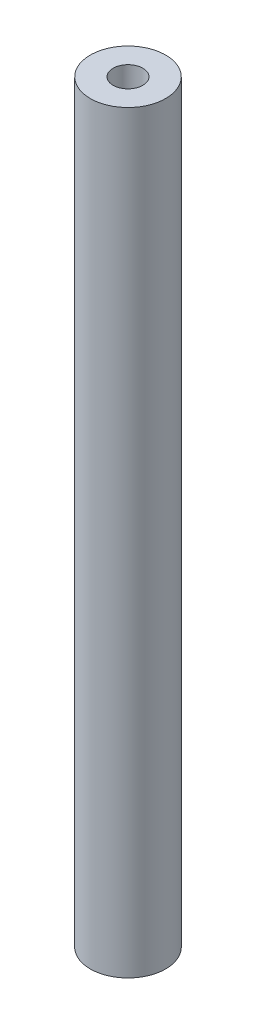
ISO-10303-21;
HEADER;
FILE_DESCRIPTION(('STEP AP214'),'2;1');
FILE_NAME('part.step','',(''),(''),'','','');
FILE_SCHEMA(('AUTOMOTIVE_DESIGN { 1 0 10303 214 1 1 1 1 }'));
ENDSEC;
DATA;
#1=APPLICATION_CONTEXT('core data for automotive mechanical design processes');
#2=APPLICATION_PROTOCOL_DEFINITION('international standard','automotive_design',2000,#1);
#3=PRODUCT_CONTEXT('',#1,'mechanical');
#4=PRODUCT('Part','Part','',(#3));
#5=PRODUCT_RELATED_PRODUCT_CATEGORY('part','',(#4));
#6=PRODUCT_DEFINITION_FORMATION('','',#4);
#7=PRODUCT_DEFINITION_CONTEXT('part definition',#1,'design');
#8=PRODUCT_DEFINITION('design','',#6,#7);
#9=PRODUCT_DEFINITION_SHAPE('','',#8);
#10=(LENGTH_UNIT() NAMED_UNIT(*) SI_UNIT(.MILLI.,.METRE.));
#11=(NAMED_UNIT(*) PLANE_ANGLE_UNIT() SI_UNIT($,.RADIAN.));
#12=(NAMED_UNIT(*) SI_UNIT($,.STERADIAN.) SOLID_ANGLE_UNIT());
#13=UNCERTAINTY_MEASURE_WITH_UNIT(LENGTH_MEASURE(1.E-05),#10,'distance_accuracy_value','');
#14=(GEOMETRIC_REPRESENTATION_CONTEXT(3) GLOBAL_UNCERTAINTY_ASSIGNED_CONTEXT((#13)) GLOBAL_UNIT_ASSIGNED_CONTEXT((#10,
#11,#12)) REPRESENTATION_CONTEXT('',''));
#15=CARTESIAN_POINT('',(0.,0.,0.));
#16=DIRECTION('',(0.,0.,1.));
#17=DIRECTION('',(1.,0.,0.));
#18=AXIS2_PLACEMENT_3D('',#15,#16,#17);
#19=CARTESIAN_POINT('',(0.,63.5,0.));
#20=DIRECTION('',(0.,-1.,0.));
#21=DIRECTION('',(0.,0.,-1.));
#22=AXIS2_PLACEMENT_3D('',#19,#20,#21);
#23=CYLINDRICAL_SURFACE('',#22,3.175);
#24=CARTESIAN_POINT('',(0.,63.5,0.));
#25=DIRECTION('',(0.,1.,0.));
#26=DIRECTION('',(0.,0.,1.));
#27=AXIS2_PLACEMENT_3D('',#24,#25,#26);
#28=CIRCLE('',#27,3.175);
#29=CARTESIAN_POINT('',(0.,63.5,3.175));
#30=VERTEX_POINT('',#29);
#31=EDGE_CURVE('E11',#30,#30,#28,.T.);
#32=ORIENTED_EDGE('',*,*,#31,.F.);
#33=EDGE_LOOP('',(#32));
#34=FACE_BOUND('',#33,.T.);
#35=CARTESIAN_POINT('',(0.,0.,0.));
#36=DIRECTION('',(0.,1.,0.));
#37=DIRECTION('',(0.,0.,1.));
#38=AXIS2_PLACEMENT_3D('',#35,#36,#37);
#39=CIRCLE('',#38,3.175);
#40=CARTESIAN_POINT('',(0.,0.,3.175));
#41=VERTEX_POINT('',#40);
#42=EDGE_CURVE('E40',#41,#41,#39,.T.);
#43=ORIENTED_EDGE('',*,*,#42,.T.);
#44=EDGE_LOOP('',(#43));
#45=FACE_BOUND('',#44,.T.);
#46=ADVANCED_FACE('F37',(#34,#45),#23,.T.);
#47=CARTESIAN_POINT('',(0.,63.5,0.));
#48=DIRECTION('',(0.,1.,0.));
#49=DIRECTION('',(0.,0.,1.));
#50=AXIS2_PLACEMENT_3D('',#47,#48,#49);
#51=PLANE('',#50);
#52=CARTESIAN_POINT('',(0.,63.5,0.));
#53=DIRECTION('',(0.,1.,0.));
#54=DIRECTION('',(0.,0.,1.));
#55=AXIS2_PLACEMENT_3D('',#52,#53,#54);
#56=CIRCLE('',#55,1.24999999999999);
#57=CARTESIAN_POINT('',(0.,63.5,1.24999999999999));
#58=VERTEX_POINT('',#57);
#59=EDGE_CURVE('E60',#58,#58,#56,.T.);
#60=ORIENTED_EDGE('',*,*,#59,.F.);
#61=EDGE_LOOP('',(#60));
#62=FACE_BOUND('',#61,.T.);
#63=ORIENTED_EDGE('',*,*,#31,.T.);
#64=EDGE_LOOP('',(#63));
#65=FACE_BOUND('',#64,.T.);
#66=ADVANCED_FACE('F79',(#62,#65),#51,.T.);
#67=CARTESIAN_POINT('',(0.,0.,0.));
#68=DIRECTION('',(0.,1.,0.));
#69=DIRECTION('',(0.,0.,1.));
#70=AXIS2_PLACEMENT_3D('',#67,#68,#69);
#71=PLANE('',#70);
#72=CARTESIAN_POINT('',(0.,0.,0.));
#73=DIRECTION('',(0.,-1.,0.));
#74=DIRECTION('',(0.,0.,-1.));
#75=AXIS2_PLACEMENT_3D('',#72,#73,#74);
#76=CIRCLE('',#75,1.24999999999999);
#77=CARTESIAN_POINT('',(0.,0.,-1.24999999999999));
#78=VERTEX_POINT('',#77);
#79=EDGE_CURVE('E61',#78,#78,#76,.T.);
#80=ORIENTED_EDGE('',*,*,#79,.F.);
#81=EDGE_LOOP('',(#80));
#82=FACE_BOUND('',#81,.T.);
#83=ORIENTED_EDGE('',*,*,#42,.F.);
#84=EDGE_LOOP('',(#83));
#85=FACE_BOUND('',#84,.T.);
#86=ADVANCED_FACE('F76',(#82,#85),#71,.F.);
#87=CARTESIAN_POINT('',(0.,50.8,0.));
#88=DIRECTION('',(0.,1.,0.));
#89=DIRECTION('',(0.,0.,1.));
#90=AXIS2_PLACEMENT_3D('',#87,#88,#89);
#91=CONICAL_SURFACE('',#90,1.25,1.02974425867665);
#92=CARTESIAN_POINT('',(0.,50.0489242262155,0.));
#93=VERTEX_POINT('',#92);
#94=VERTEX_LOOP('',#93);
#95=FACE_BOUND('',#94,.T.);
#96=CARTESIAN_POINT('',(0.,50.8,0.));
#97=DIRECTION('',(0.,1.,0.));
#98=DIRECTION('',(0.,0.,1.));
#99=AXIS2_PLACEMENT_3D('',#96,#97,#98);
#100=CIRCLE('',#99,1.25);
#101=CARTESIAN_POINT('',(0.,50.8,1.25));
#102=VERTEX_POINT('',#101);
#103=EDGE_CURVE('E64',#102,#102,#100,.T.);
#104=ORIENTED_EDGE('',*,*,#103,.T.);
#105=EDGE_LOOP('',(#104));
#106=FACE_BOUND('',#105,.T.);
#107=ADVANCED_FACE('F78',(#95,#106),#91,.F.);
#108=CARTESIAN_POINT('',(0.,63.5,0.));
#109=DIRECTION('',(0.,1.,0.));
#110=DIRECTION('',(0.,0.,1.));
#111=AXIS2_PLACEMENT_3D('',#108,#109,#110);
#112=CYLINDRICAL_SURFACE('',#111,1.24999999999999);
#113=ORIENTED_EDGE('',*,*,#103,.F.);
#114=EDGE_LOOP('',(#113));
#115=FACE_BOUND('',#114,.T.);
#116=ORIENTED_EDGE('',*,*,#59,.T.);
#117=EDGE_LOOP('',(#116));
#118=FACE_BOUND('',#117,.T.);
#119=ADVANCED_FACE('F54',(#115,#118),#112,.F.);
#120=CARTESIAN_POINT('',(0.,12.7,0.));
#121=DIRECTION('',(0.,-1.,0.));
#122=DIRECTION('',(0.,0.,-1.));
#123=AXIS2_PLACEMENT_3D('',#120,#121,#122);
#124=CONICAL_SURFACE('',#123,1.24999999999999,1.02974425867665);
#125=CARTESIAN_POINT('',(0.,13.4510757737845,0.));
#126=VERTEX_POINT('',#125);
#127=VERTEX_LOOP('',#126);
#128=FACE_BOUND('',#127,.T.);
#129=CARTESIAN_POINT('',(0.,12.7,0.));
#130=DIRECTION('',(0.,-1.,0.));
#131=DIRECTION('',(0.,0.,-1.));
#132=AXIS2_PLACEMENT_3D('',#129,#130,#131);
#133=CIRCLE('',#132,1.24999999999999);
#134=CARTESIAN_POINT('',(0.,12.7,-1.24999999999999));
#135=VERTEX_POINT('',#134);
#136=EDGE_CURVE('E58',#135,#135,#133,.T.);
#137=ORIENTED_EDGE('',*,*,#136,.T.);
#138=EDGE_LOOP('',(#137));
#139=FACE_BOUND('',#138,.T.);
#140=ADVANCED_FACE('F50',(#128,#139),#124,.F.);
#141=CARTESIAN_POINT('',(0.,0.,0.));
#142=DIRECTION('',(0.,-1.,0.));
#143=DIRECTION('',(0.,0.,-1.));
#144=AXIS2_PLACEMENT_3D('',#141,#142,#143);
#145=CYLINDRICAL_SURFACE('',#144,1.24999999999999);
#146=ORIENTED_EDGE('',*,*,#136,.F.);
#147=EDGE_LOOP('',(#146));
#148=FACE_BOUND('',#147,.T.);
#149=ORIENTED_EDGE('',*,*,#79,.T.);
#150=EDGE_LOOP('',(#149));
#151=FACE_BOUND('',#150,.T.);
#152=ADVANCED_FACE('F53',(#148,#151),#145,.F.);
#153=CLOSED_SHELL('',(#46,#66,#86,#107,#119,#140,#152));
#154=MANIFOLD_SOLID_BREP('B2',#153);
#155=ADVANCED_BREP_SHAPE_REPRESENTATION('',(#18,#154),#14);
#156=SHAPE_DEFINITION_REPRESENTATION(#9,#155);
ENDSEC;
END-ISO-10303-21;
